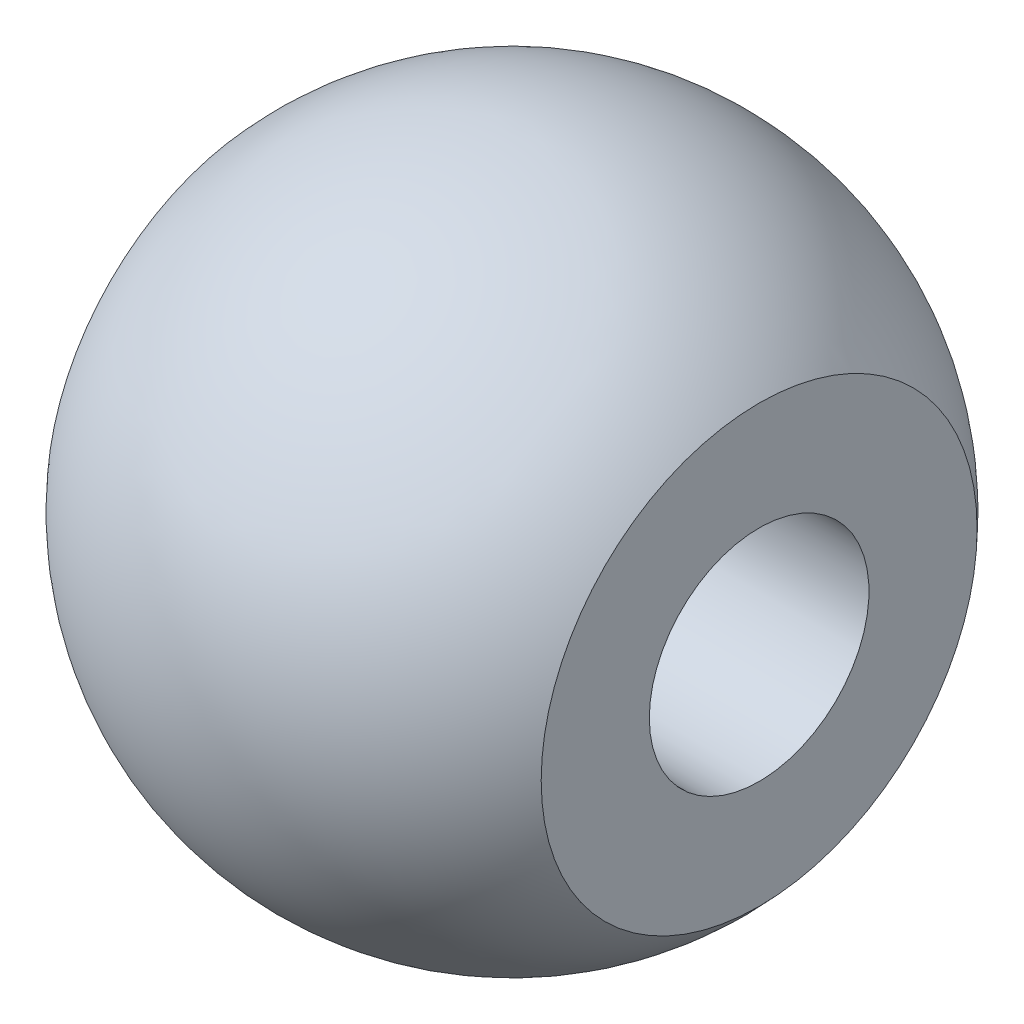
ISO-10303-21;
HEADER;
FILE_DESCRIPTION(('STEP AP214'),'2;1');
FILE_NAME('part.step','',(''),(''),'','','');
FILE_SCHEMA(('AUTOMOTIVE_DESIGN { 1 0 10303 214 1 1 1 1 }'));
ENDSEC;
DATA;
#1=APPLICATION_CONTEXT('core data for automotive mechanical design processes');
#2=APPLICATION_PROTOCOL_DEFINITION('international standard','automotive_design',2000,#1);
#3=PRODUCT_CONTEXT('',#1,'mechanical');
#4=PRODUCT('Part','Part','',(#3));
#5=PRODUCT_RELATED_PRODUCT_CATEGORY('part','',(#4));
#6=PRODUCT_DEFINITION_FORMATION('','',#4);
#7=PRODUCT_DEFINITION_CONTEXT('part definition',#1,'design');
#8=PRODUCT_DEFINITION('design','',#6,#7);
#9=PRODUCT_DEFINITION_SHAPE('','',#8);
#10=(LENGTH_UNIT() NAMED_UNIT(*) SI_UNIT(.MILLI.,.METRE.));
#11=(NAMED_UNIT(*) PLANE_ANGLE_UNIT() SI_UNIT($,.RADIAN.));
#12=(NAMED_UNIT(*) SI_UNIT($,.STERADIAN.) SOLID_ANGLE_UNIT());
#13=UNCERTAINTY_MEASURE_WITH_UNIT(LENGTH_MEASURE(1.E-05),#10,'distance_accuracy_value','');
#14=(GEOMETRIC_REPRESENTATION_CONTEXT(3) GLOBAL_UNCERTAINTY_ASSIGNED_CONTEXT((#13)) GLOBAL_UNIT_ASSIGNED_CONTEXT((#10,
#11,#12)) REPRESENTATION_CONTEXT('',''));
#15=CARTESIAN_POINT('',(0.,0.,0.));
#16=DIRECTION('',(0.,0.,1.));
#17=DIRECTION('',(1.,0.,0.));
#18=AXIS2_PLACEMENT_3D('',#15,#16,#17);
#19=CARTESIAN_POINT('',(0.,0.,0.));
#20=DIRECTION('',(-1.,0.,0.));
#21=DIRECTION('',(0.,-1.,0.));
#22=AXIS2_PLACEMENT_3D('',#19,#20,#21);
#23=SPHERICAL_SURFACE('',#22,6.);
#24=CARTESIAN_POINT('',(4.5,0.,0.));
#25=DIRECTION('',(-1.,0.,0.));
#26=DIRECTION('',(0.,0.,1.));
#27=AXIS2_PLACEMENT_3D('',#24,#25,#26);
#28=CIRCLE('',#27,3.96862696659689);
#29=CARTESIAN_POINT('',(4.5,0.,3.96862696659689));
#30=VERTEX_POINT('',#29);
#31=EDGE_CURVE('E10',#30,#30,#28,.T.);
#32=ORIENTED_EDGE('',*,*,#31,.T.);
#33=EDGE_LOOP('',(#32));
#34=FACE_BOUND('',#33,.T.);
#35=CARTESIAN_POINT('',(-4.5,0.,0.));
#36=DIRECTION('',(-1.,0.,0.));
#37=DIRECTION('',(0.,0.,1.));
#38=AXIS2_PLACEMENT_3D('',#35,#36,#37);
#39=CIRCLE('',#38,3.96862696659689);
#40=CARTESIAN_POINT('',(-4.5,0.,3.96862696659689));
#41=VERTEX_POINT('',#40);
#42=EDGE_CURVE('E37',#41,#41,#39,.T.);
#43=ORIENTED_EDGE('',*,*,#42,.F.);
#44=EDGE_LOOP('',(#43));
#45=FACE_BOUND('',#44,.T.);
#46=ADVANCED_FACE('F31',(#34,#45),#23,.T.);
#47=CARTESIAN_POINT('',(4.5,-3.96862696659689,0.));
#48=DIRECTION('',(1.,0.,0.));
#49=DIRECTION('',(0.,0.,-1.));
#50=AXIS2_PLACEMENT_3D('',#47,#48,#49);
#51=PLANE('',#50);
#52=CARTESIAN_POINT('',(4.5,0.,0.));
#53=DIRECTION('',(-1.,0.,0.));
#54=DIRECTION('',(0.,0.,1.));
#55=AXIS2_PLACEMENT_3D('',#52,#53,#54);
#56=CIRCLE('',#55,2.);
#57=CARTESIAN_POINT('',(4.5,0.,2.));
#58=VERTEX_POINT('',#57);
#59=EDGE_CURVE('E50',#58,#58,#56,.T.);
#60=ORIENTED_EDGE('',*,*,#59,.T.);
#61=EDGE_LOOP('',(#60));
#62=FACE_BOUND('',#61,.T.);
#63=ORIENTED_EDGE('',*,*,#31,.F.);
#64=EDGE_LOOP('',(#63));
#65=FACE_BOUND('',#64,.T.);
#66=ADVANCED_FACE('F54',(#62,#65),#51,.T.);
#67=CARTESIAN_POINT('',(-4.5,-3.96862696659689,0.));
#68=DIRECTION('',(-1.,0.,0.));
#69=DIRECTION('',(0.,0.,1.));
#70=AXIS2_PLACEMENT_3D('',#67,#68,#69);
#71=PLANE('',#70);
#72=CARTESIAN_POINT('',(-4.5,0.,0.));
#73=DIRECTION('',(-1.,0.,0.));
#74=DIRECTION('',(0.,0.,1.));
#75=AXIS2_PLACEMENT_3D('',#72,#73,#74);
#76=CIRCLE('',#75,2.99999999999998);
#77=CARTESIAN_POINT('',(-4.5,0.,2.99999999999998));
#78=VERTEX_POINT('',#77);
#79=EDGE_CURVE('E41',#78,#78,#76,.T.);
#80=ORIENTED_EDGE('',*,*,#79,.F.);
#81=EDGE_LOOP('',(#80));
#82=FACE_BOUND('',#81,.T.);
#83=ORIENTED_EDGE('',*,*,#42,.T.);
#84=EDGE_LOOP('',(#83));
#85=FACE_BOUND('',#84,.T.);
#86=ADVANCED_FACE('F65',(#82,#85),#71,.T.);
#87=CARTESIAN_POINT('',(-3.5,0.,0.));
#88=DIRECTION('',(-1.,0.,0.));
#89=DIRECTION('',(0.,0.,1.));
#90=AXIS2_PLACEMENT_3D('',#87,#88,#89);
#91=CONICAL_SURFACE('',#90,2.,0.785398163397437);
#92=ORIENTED_EDGE('',*,*,#79,.T.);
#93=EDGE_LOOP('',(#92));
#94=FACE_BOUND('',#93,.T.);
#95=CARTESIAN_POINT('',(-3.5,0.,0.));
#96=DIRECTION('',(-1.,0.,0.));
#97=DIRECTION('',(0.,0.,1.));
#98=AXIS2_PLACEMENT_3D('',#95,#96,#97);
#99=CIRCLE('',#98,2.);
#100=CARTESIAN_POINT('',(-3.5,0.,2.));
#101=VERTEX_POINT('',#100);
#102=EDGE_CURVE('E45',#101,#101,#99,.T.);
#103=ORIENTED_EDGE('',*,*,#102,.F.);
#104=EDGE_LOOP('',(#103));
#105=FACE_BOUND('',#104,.T.);
#106=ADVANCED_FACE('F59',(#94,#105),#91,.F.);
#107=CARTESIAN_POINT('',(-4.5,0.,0.));
#108=DIRECTION('',(-1.,0.,0.));
#109=DIRECTION('',(0.,0.,1.));
#110=AXIS2_PLACEMENT_3D('',#107,#108,#109);
#111=CYLINDRICAL_SURFACE('',#110,2.);
#112=ORIENTED_EDGE('',*,*,#102,.T.);
#113=EDGE_LOOP('',(#112));
#114=FACE_BOUND('',#113,.T.);
#115=ORIENTED_EDGE('',*,*,#59,.F.);
#116=EDGE_LOOP('',(#115));
#117=FACE_BOUND('',#116,.T.);
#118=ADVANCED_FACE('F57',(#114,#117),#111,.F.);
#119=CLOSED_SHELL('',(#46,#66,#86,#106,#118));
#120=MANIFOLD_SOLID_BREP('B2',#119);
#121=ADVANCED_BREP_SHAPE_REPRESENTATION('',(#18,#120),#14);
#122=SHAPE_DEFINITION_REPRESENTATION(#9,#121);
ENDSEC;
END-ISO-10303-21;
